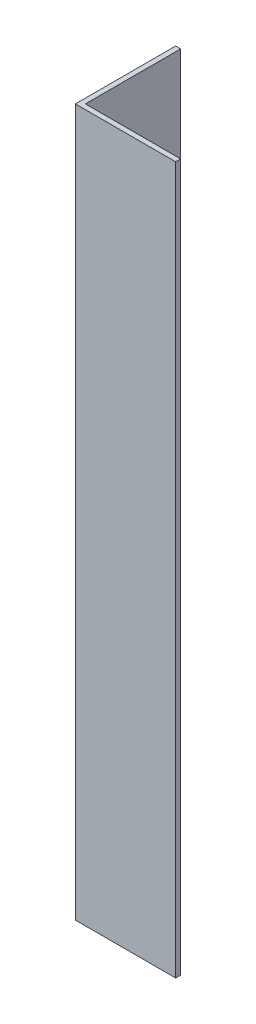
ISO-10303-21;
HEADER;
FILE_DESCRIPTION(('STEP AP214'),'2;1');
FILE_NAME('part.step','',(''),(''),'','','');
FILE_SCHEMA(('AUTOMOTIVE_DESIGN { 1 0 10303 214 1 1 1 1 }'));
ENDSEC;
DATA;
#1=APPLICATION_CONTEXT('core data for automotive mechanical design processes');
#2=APPLICATION_PROTOCOL_DEFINITION('international standard','automotive_design',2000,#1);
#3=PRODUCT_CONTEXT('',#1,'mechanical');
#4=PRODUCT('Part','Part','',(#3));
#5=PRODUCT_RELATED_PRODUCT_CATEGORY('part','',(#4));
#6=PRODUCT_DEFINITION_FORMATION('','',#4);
#7=PRODUCT_DEFINITION_CONTEXT('part definition',#1,'design');
#8=PRODUCT_DEFINITION('design','',#6,#7);
#9=PRODUCT_DEFINITION_SHAPE('','',#8);
#10=(LENGTH_UNIT() NAMED_UNIT(*) SI_UNIT(.MILLI.,.METRE.));
#11=(NAMED_UNIT(*) PLANE_ANGLE_UNIT() SI_UNIT($,.RADIAN.));
#12=(NAMED_UNIT(*) SI_UNIT($,.STERADIAN.) SOLID_ANGLE_UNIT());
#13=UNCERTAINTY_MEASURE_WITH_UNIT(LENGTH_MEASURE(1.E-05),#10,'distance_accuracy_value','');
#14=(GEOMETRIC_REPRESENTATION_CONTEXT(3) GLOBAL_UNCERTAINTY_ASSIGNED_CONTEXT((#13)) GLOBAL_UNIT_ASSIGNED_CONTEXT((#10,
#11,#12)) REPRESENTATION_CONTEXT('',''));
#15=CARTESIAN_POINT('',(0.,0.,0.));
#16=DIRECTION('',(0.,0.,1.));
#17=DIRECTION('',(1.,0.,0.));
#18=AXIS2_PLACEMENT_3D('',#15,#16,#17);
#19=CARTESIAN_POINT('',(20.,141.,0.));
#20=DIRECTION('',(0.,0.,-1.));
#21=DIRECTION('',(-1.,0.,0.));
#22=AXIS2_PLACEMENT_3D('',#19,#20,#21);
#23=PLANE('',#22);
#24=DIRECTION('',(1.,0.,0.));
#25=VECTOR('',#24,1.);
#26=CARTESIAN_POINT('',(20.,0.,0.));
#27=LINE('',#26,#25);
#28=CARTESIAN_POINT('',(0.,0.,0.));
#29=VERTEX_POINT('',#28);
#30=CARTESIAN_POINT('',(20.,0.,0.));
#31=VERTEX_POINT('',#30);
#32=EDGE_CURVE('E119',#29,#31,#27,.T.);
#33=ORIENTED_EDGE('',*,*,#32,.T.);
#34=DIRECTION('',(0.,-1.,0.));
#35=VECTOR('',#34,1.);
#36=CARTESIAN_POINT('',(20.,141.,0.));
#37=LINE('',#36,#35);
#38=CARTESIAN_POINT('',(20.,141.,0.));
#39=VERTEX_POINT('',#38);
#40=EDGE_CURVE('E11',#39,#31,#37,.T.);
#41=ORIENTED_EDGE('',*,*,#40,.F.);
#42=DIRECTION('',(1.,0.,0.));
#43=VECTOR('',#42,1.);
#44=CARTESIAN_POINT('',(20.,141.,0.));
#45=LINE('',#44,#43);
#46=CARTESIAN_POINT('',(0.,141.,0.));
#47=VERTEX_POINT('',#46);
#48=EDGE_CURVE('E129',#47,#39,#45,.T.);
#49=ORIENTED_EDGE('',*,*,#48,.F.);
#50=DIRECTION('',(0.,-1.,0.));
#51=VECTOR('',#50,1.);
#52=CARTESIAN_POINT('',(0.,141.,0.));
#53=LINE('',#52,#51);
#54=EDGE_CURVE('E115',#47,#29,#53,.T.);
#55=ORIENTED_EDGE('',*,*,#54,.T.);
#56=EDGE_LOOP('',(#33,#41,#49,#55));
#57=FACE_BOUND('',#56,.T.);
#58=ADVANCED_FACE('F35',(#57),#23,.F.);
#59=CARTESIAN_POINT('',(20.,141.,-0.999999999999998));
#60=DIRECTION('',(-1.,0.,0.));
#61=DIRECTION('',(0.,0.,1.));
#62=AXIS2_PLACEMENT_3D('',#59,#60,#61);
#63=PLANE('',#62);
#64=DIRECTION('',(0.,0.,-1.));
#65=VECTOR('',#64,1.);
#66=CARTESIAN_POINT('',(20.,0.,-0.999999999999998));
#67=LINE('',#66,#65);
#68=CARTESIAN_POINT('',(20.,0.,-0.999999999999998));
#69=VERTEX_POINT('',#68);
#70=EDGE_CURVE('E122',#31,#69,#67,.T.);
#71=ORIENTED_EDGE('',*,*,#70,.T.);
#72=DIRECTION('',(0.,-1.,0.));
#73=VECTOR('',#72,1.);
#74=CARTESIAN_POINT('',(20.,141.,-0.999999999999998));
#75=LINE('',#74,#73);
#76=CARTESIAN_POINT('',(20.,141.,-0.999999999999998));
#77=VERTEX_POINT('',#76);
#78=EDGE_CURVE('E43',#77,#69,#75,.T.);
#79=ORIENTED_EDGE('',*,*,#78,.F.);
#80=DIRECTION('',(0.,0.,-1.));
#81=VECTOR('',#80,1.);
#82=CARTESIAN_POINT('',(20.,141.,-0.999999999999998));
#83=LINE('',#82,#81);
#84=EDGE_CURVE('E88',#39,#77,#83,.T.);
#85=ORIENTED_EDGE('',*,*,#84,.F.);
#86=ORIENTED_EDGE('',*,*,#40,.T.);
#87=EDGE_LOOP('',(#71,#79,#85,#86));
#88=FACE_BOUND('',#87,.T.);
#89=ADVANCED_FACE('F153',(#88),#63,.F.);
#90=CARTESIAN_POINT('',(1.,141.,-0.999999999999997));
#91=DIRECTION('',(0.,0.,1.));
#92=DIRECTION('',(1.,0.,0.));
#93=AXIS2_PLACEMENT_3D('',#90,#91,#92);
#94=PLANE('',#93);
#95=DIRECTION('',(-1.,0.,0.));
#96=VECTOR('',#95,1.);
#97=CARTESIAN_POINT('',(1.,0.,-0.999999999999997));
#98=LINE('',#97,#96);
#99=CARTESIAN_POINT('',(1.,0.,-0.999999999999997));
#100=VERTEX_POINT('',#99);
#101=EDGE_CURVE('E124',#69,#100,#98,.T.);
#102=ORIENTED_EDGE('',*,*,#101,.T.);
#103=DIRECTION('',(0.,-1.,0.));
#104=VECTOR('',#103,1.);
#105=CARTESIAN_POINT('',(1.,141.,-0.999999999999997));
#106=LINE('',#105,#104);
#107=CARTESIAN_POINT('',(1.,141.,-0.999999999999997));
#108=VERTEX_POINT('',#107);
#109=EDGE_CURVE('E110',#108,#100,#106,.T.);
#110=ORIENTED_EDGE('',*,*,#109,.F.);
#111=DIRECTION('',(-1.,0.,0.));
#112=VECTOR('',#111,1.);
#113=CARTESIAN_POINT('',(1.,141.,-0.999999999999997));
#114=LINE('',#113,#112);
#115=EDGE_CURVE('E101',#77,#108,#114,.T.);
#116=ORIENTED_EDGE('',*,*,#115,.F.);
#117=ORIENTED_EDGE('',*,*,#78,.T.);
#118=EDGE_LOOP('',(#102,#110,#116,#117));
#119=FACE_BOUND('',#118,.T.);
#120=ADVANCED_FACE('F135',(#119),#94,.F.);
#121=CARTESIAN_POINT('',(0.999999999999998,141.,-20.));
#122=DIRECTION('',(-1.,0.,0.));
#123=DIRECTION('',(0.,0.,1.));
#124=AXIS2_PLACEMENT_3D('',#121,#122,#123);
#125=PLANE('',#124);
#126=DIRECTION('',(0.,0.,-1.));
#127=VECTOR('',#126,1.);
#128=CARTESIAN_POINT('',(0.999999999999998,0.,-20.));
#129=LINE('',#128,#127);
#130=CARTESIAN_POINT('',(0.999999999999998,0.,-20.));
#131=VERTEX_POINT('',#130);
#132=EDGE_CURVE('E109',#100,#131,#129,.T.);
#133=ORIENTED_EDGE('',*,*,#132,.T.);
#134=DIRECTION('',(0.,-1.,0.));
#135=VECTOR('',#134,1.);
#136=CARTESIAN_POINT('',(0.999999999999998,141.,-20.));
#137=LINE('',#136,#135);
#138=CARTESIAN_POINT('',(0.999999999999998,141.,-20.));
#139=VERTEX_POINT('',#138);
#140=EDGE_CURVE('E106',#139,#131,#137,.T.);
#141=ORIENTED_EDGE('',*,*,#140,.F.);
#142=DIRECTION('',(0.,0.,-1.));
#143=VECTOR('',#142,1.);
#144=CARTESIAN_POINT('',(0.999999999999998,141.,-20.));
#145=LINE('',#144,#143);
#146=EDGE_CURVE('E95',#108,#139,#145,.T.);
#147=ORIENTED_EDGE('',*,*,#146,.F.);
#148=ORIENTED_EDGE('',*,*,#109,.T.);
#149=EDGE_LOOP('',(#133,#141,#147,#148));
#150=FACE_BOUND('',#149,.T.);
#151=ADVANCED_FACE('F107',(#150),#125,.F.);
#152=CARTESIAN_POINT('',(0.,141.,-20.));
#153=DIRECTION('',(0.,0.,1.));
#154=DIRECTION('',(1.,0.,0.));
#155=AXIS2_PLACEMENT_3D('',#152,#153,#154);
#156=PLANE('',#155);
#157=DIRECTION('',(-1.,0.,0.));
#158=VECTOR('',#157,1.);
#159=CARTESIAN_POINT('',(0.,0.,-20.));
#160=LINE('',#159,#158);
#161=CARTESIAN_POINT('',(0.,0.,-20.));
#162=VERTEX_POINT('',#161);
#163=EDGE_CURVE('E74',#131,#162,#160,.T.);
#164=ORIENTED_EDGE('',*,*,#163,.T.);
#165=DIRECTION('',(0.,-1.,0.));
#166=VECTOR('',#165,1.);
#167=CARTESIAN_POINT('',(0.,141.,-20.));
#168=LINE('',#167,#166);
#169=CARTESIAN_POINT('',(0.,141.,-20.));
#170=VERTEX_POINT('',#169);
#171=EDGE_CURVE('E111',#170,#162,#168,.T.);
#172=ORIENTED_EDGE('',*,*,#171,.F.);
#173=DIRECTION('',(-1.,0.,0.));
#174=VECTOR('',#173,1.);
#175=CARTESIAN_POINT('',(0.,141.,-20.));
#176=LINE('',#175,#174);
#177=EDGE_CURVE('E99',#139,#170,#176,.T.);
#178=ORIENTED_EDGE('',*,*,#177,.F.);
#179=ORIENTED_EDGE('',*,*,#140,.T.);
#180=EDGE_LOOP('',(#164,#172,#178,#179));
#181=FACE_BOUND('',#180,.T.);
#182=ADVANCED_FACE('F113',(#181),#156,.F.);
#183=CARTESIAN_POINT('',(0.,141.,0.));
#184=DIRECTION('',(1.,0.,0.));
#185=DIRECTION('',(0.,0.,-1.));
#186=AXIS2_PLACEMENT_3D('',#183,#184,#185);
#187=PLANE('',#186);
#188=DIRECTION('',(0.,0.,1.));
#189=VECTOR('',#188,1.);
#190=CARTESIAN_POINT('',(0.,0.,0.));
#191=LINE('',#190,#189);
#192=EDGE_CURVE('E80',#162,#29,#191,.T.);
#193=ORIENTED_EDGE('',*,*,#192,.T.);
#194=ORIENTED_EDGE('',*,*,#54,.F.);
#195=DIRECTION('',(0.,0.,1.));
#196=VECTOR('',#195,1.);
#197=CARTESIAN_POINT('',(0.,141.,0.));
#198=LINE('',#197,#196);
#199=EDGE_CURVE('E51',#170,#47,#198,.T.);
#200=ORIENTED_EDGE('',*,*,#199,.F.);
#201=ORIENTED_EDGE('',*,*,#171,.T.);
#202=EDGE_LOOP('',(#193,#194,#200,#201));
#203=FACE_BOUND('',#202,.T.);
#204=ADVANCED_FACE('F142',(#203),#187,.F.);
#205=CARTESIAN_POINT('',(0.,141.,0.));
#206=DIRECTION('',(0.,-1.,0.));
#207=DIRECTION('',(0.,0.,-1.));
#208=AXIS2_PLACEMENT_3D('',#205,#206,#207);
#209=PLANE('',#208);
#210=ORIENTED_EDGE('',*,*,#48,.T.);
#211=ORIENTED_EDGE('',*,*,#84,.T.);
#212=ORIENTED_EDGE('',*,*,#115,.T.);
#213=ORIENTED_EDGE('',*,*,#146,.T.);
#214=ORIENTED_EDGE('',*,*,#177,.T.);
#215=ORIENTED_EDGE('',*,*,#199,.T.);
#216=EDGE_LOOP('',(#210,#211,#212,#213,#214,#215));
#217=FACE_BOUND('',#216,.T.);
#218=ADVANCED_FACE('F97',(#217),#209,.F.);
#219=CARTESIAN_POINT('',(0.,0.,0.));
#220=DIRECTION('',(0.,-1.,0.));
#221=DIRECTION('',(0.,0.,-1.));
#222=AXIS2_PLACEMENT_3D('',#219,#220,#221);
#223=PLANE('',#222);
#224=ORIENTED_EDGE('',*,*,#32,.F.);
#225=ORIENTED_EDGE('',*,*,#192,.F.);
#226=ORIENTED_EDGE('',*,*,#163,.F.);
#227=ORIENTED_EDGE('',*,*,#132,.F.);
#228=ORIENTED_EDGE('',*,*,#101,.F.);
#229=ORIENTED_EDGE('',*,*,#70,.F.);
#230=EDGE_LOOP('',(#224,#225,#226,#227,#228,#229));
#231=FACE_BOUND('',#230,.T.);
#232=ADVANCED_FACE('F138',(#231),#223,.T.);
#233=CLOSED_SHELL('',(#58,#89,#120,#151,#182,#204,#218,#232));
#234=MANIFOLD_SOLID_BREP('B2',#233);
#235=ADVANCED_BREP_SHAPE_REPRESENTATION('',(#18,#234),#14);
#236=SHAPE_DEFINITION_REPRESENTATION(#9,#235);
ENDSEC;
END-ISO-10303-21;
